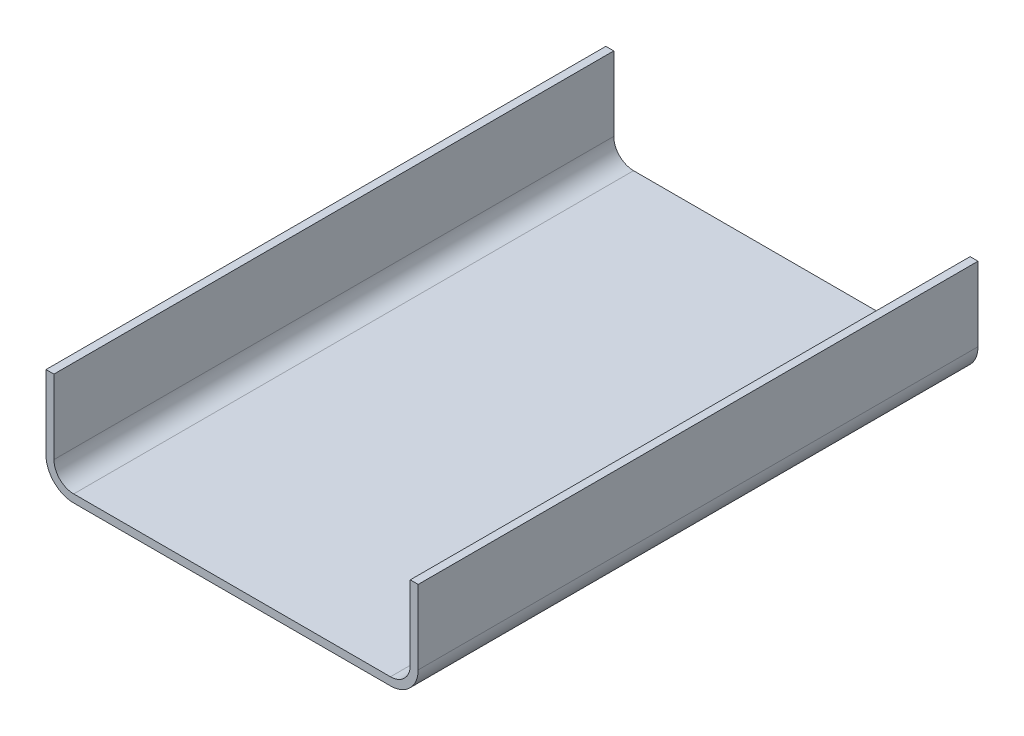
ISO-10303-21;
HEADER;
FILE_DESCRIPTION(('STEP AP214'),'2;1');
FILE_NAME('part.step','',(''),(''),'','','');
FILE_SCHEMA(('AUTOMOTIVE_DESIGN { 1 0 10303 214 1 1 1 1 }'));
ENDSEC;
DATA;
#1=APPLICATION_CONTEXT('core data for automotive mechanical design processes');
#2=APPLICATION_PROTOCOL_DEFINITION('international standard','automotive_design',2000,#1);
#3=PRODUCT_CONTEXT('',#1,'mechanical');
#4=PRODUCT('Part','Part','',(#3));
#5=PRODUCT_RELATED_PRODUCT_CATEGORY('part','',(#4));
#6=PRODUCT_DEFINITION_FORMATION('','',#4);
#7=PRODUCT_DEFINITION_CONTEXT('part definition',#1,'design');
#8=PRODUCT_DEFINITION('design','',#6,#7);
#9=PRODUCT_DEFINITION_SHAPE('','',#8);
#10=(LENGTH_UNIT() NAMED_UNIT(*) SI_UNIT(.MILLI.,.METRE.));
#11=(NAMED_UNIT(*) PLANE_ANGLE_UNIT() SI_UNIT($,.RADIAN.));
#12=(NAMED_UNIT(*) SI_UNIT($,.STERADIAN.) SOLID_ANGLE_UNIT());
#13=UNCERTAINTY_MEASURE_WITH_UNIT(LENGTH_MEASURE(1.E-05),#10,'distance_accuracy_value','');
#14=(GEOMETRIC_REPRESENTATION_CONTEXT(3) GLOBAL_UNCERTAINTY_ASSIGNED_CONTEXT((#13)) GLOBAL_UNIT_ASSIGNED_CONTEXT((#10,
#11,#12)) REPRESENTATION_CONTEXT('',''));
#15=CARTESIAN_POINT('',(0.,0.,0.));
#16=DIRECTION('',(0.,0.,1.));
#17=DIRECTION('',(1.,0.,0.));
#18=AXIS2_PLACEMENT_3D('',#15,#16,#17);
#19=CARTESIAN_POINT('',(0.,-77.851,0.));
#20=DIRECTION('',(0.,1.,0.));
#21=DIRECTION('',(0.,0.,1.));
#22=AXIS2_PLACEMENT_3D('',#19,#20,#21);
#23=PLANE('',#22);
#24=DIRECTION('',(0.,0.,-1.));
#25=VECTOR('',#24,1.);
#26=CARTESIAN_POINT('',(119.38,-77.851,156.718));
#27=LINE('',#26,#25);
#28=CARTESIAN_POINT('',(119.38,-77.851,666.242));
#29=VERTEX_POINT('',#28);
#30=CARTESIAN_POINT('',(119.38,-77.851,307.086));
#31=VERTEX_POINT('',#30);
#32=EDGE_CURVE('E11',#29,#31,#27,.T.);
#33=ORIENTED_EDGE('',*,*,#32,.T.);
#34=DIRECTION('',(1.,0.,0.));
#35=VECTOR('',#34,1.);
#36=CARTESIAN_POINT('',(114.3,-77.851,307.086));
#37=LINE('',#36,#35);
#38=CARTESIAN_POINT('',(114.3,-77.851,307.086));
#39=VERTEX_POINT('',#38);
#40=EDGE_CURVE('E197',#39,#31,#37,.T.);
#41=ORIENTED_EDGE('',*,*,#40,.F.);
#42=DIRECTION('',(0.,0.,-1.));
#43=VECTOR('',#42,1.);
#44=CARTESIAN_POINT('',(114.3,-77.851,156.718));
#45=LINE('',#44,#43);
#46=CARTESIAN_POINT('',(114.3,-77.851,666.242));
#47=VERTEX_POINT('',#46);
#48=EDGE_CURVE('E214',#47,#39,#45,.T.);
#49=ORIENTED_EDGE('',*,*,#48,.F.);
#50=DIRECTION('',(-1.,0.,0.));
#51=VECTOR('',#50,1.);
#52=CARTESIAN_POINT('',(-101.6,-77.851,666.242));
#53=LINE('',#52,#51);
#54=EDGE_CURVE('E50',#29,#47,#53,.T.);
#55=ORIENTED_EDGE('',*,*,#54,.F.);
#56=EDGE_LOOP('',(#33,#41,#49,#55));
#57=FACE_BOUND('',#56,.T.);
#58=ADVANCED_FACE('F36',(#57),#23,.T.);
#59=DIRECTION('',(1.,0.,0.));
#60=VECTOR('',#59,1.);
#61=CARTESIAN_POINT('',(-119.38,-77.851,307.086));
#62=LINE('',#61,#60);
#63=CARTESIAN_POINT('',(-119.38,-77.851,307.086));
#64=VERTEX_POINT('',#63);
#65=CARTESIAN_POINT('',(-114.3,-77.851,307.086));
#66=VERTEX_POINT('',#65);
#67=EDGE_CURVE('E209',#64,#66,#62,.T.);
#68=ORIENTED_EDGE('',*,*,#67,.F.);
#69=DIRECTION('',(0.,0.,1.));
#70=VECTOR('',#69,1.);
#71=CARTESIAN_POINT('',(-119.38,-77.851,156.718));
#72=LINE('',#71,#70);
#73=CARTESIAN_POINT('',(-119.38,-77.851,666.242));
#74=VERTEX_POINT('',#73);
#75=EDGE_CURVE('E43',#64,#74,#72,.T.);
#76=ORIENTED_EDGE('',*,*,#75,.T.);
#77=CARTESIAN_POINT('',(-114.3,-77.851,666.242));
#78=VERTEX_POINT('',#77);
#79=EDGE_CURVE('E211',#78,#74,#53,.T.);
#80=ORIENTED_EDGE('',*,*,#79,.F.);
#81=DIRECTION('',(0.,0.,1.));
#82=VECTOR('',#81,1.);
#83=CARTESIAN_POINT('',(-114.3,-77.851,156.718));
#84=LINE('',#83,#82);
#85=EDGE_CURVE('E140',#66,#78,#84,.T.);
#86=ORIENTED_EDGE('',*,*,#85,.F.);
#87=EDGE_LOOP('',(#68,#76,#80,#86));
#88=FACE_BOUND('',#87,.T.);
#89=ADVANCED_FACE('F235',(#88),#23,.T.);
#90=CARTESIAN_POINT('',(101.6,-125.349,497.332));
#91=DIRECTION('',(0.,0.,-1.));
#92=DIRECTION('',(-1.,0.,0.));
#93=AXIS2_PLACEMENT_3D('',#90,#91,#92);
#94=CYLINDRICAL_SURFACE('',#93,17.78);
#95=CARTESIAN_POINT('',(101.6,-125.349,307.086));
#96=DIRECTION('',(0.,0.,1.));
#97=DIRECTION('',(1.,0.,0.));
#98=AXIS2_PLACEMENT_3D('',#95,#96,#97);
#99=CIRCLE('',#98,17.78);
#100=CARTESIAN_POINT('',(101.6,-143.129,307.086));
#101=VERTEX_POINT('',#100);
#102=CARTESIAN_POINT('',(119.38,-125.349,307.086));
#103=VERTEX_POINT('',#102);
#104=EDGE_CURVE('E167',#101,#103,#99,.T.);
#105=ORIENTED_EDGE('',*,*,#104,.T.);
#106=DIRECTION('',(0.,0.,-1.));
#107=VECTOR('',#106,1.);
#108=CARTESIAN_POINT('',(119.38,-125.349,497.332));
#109=LINE('',#108,#107);
#110=CARTESIAN_POINT('',(119.38,-125.349,666.242));
#111=VERTEX_POINT('',#110);
#112=EDGE_CURVE('E133',#111,#103,#109,.T.);
#113=ORIENTED_EDGE('',*,*,#112,.F.);
#114=CARTESIAN_POINT('',(101.6,-125.349,666.242));
#115=DIRECTION('',(0.,0.,1.));
#116=DIRECTION('',(1.,0.,0.));
#117=AXIS2_PLACEMENT_3D('',#114,#115,#116);
#118=CIRCLE('',#117,17.78);
#119=CARTESIAN_POINT('',(101.6,-143.129,666.242));
#120=VERTEX_POINT('',#119);
#121=EDGE_CURVE('E157',#120,#111,#118,.T.);
#122=ORIENTED_EDGE('',*,*,#121,.F.);
#123=DIRECTION('',(0.,0.,-1.));
#124=VECTOR('',#123,1.);
#125=CARTESIAN_POINT('',(101.6,-143.129,497.332));
#126=LINE('',#125,#124);
#127=EDGE_CURVE('E189',#120,#101,#126,.T.);
#128=ORIENTED_EDGE('',*,*,#127,.T.);
#129=EDGE_LOOP('',(#105,#113,#122,#128));
#130=FACE_BOUND('',#129,.T.);
#131=ADVANCED_FACE('F249',(#130),#94,.T.);
#132=CARTESIAN_POINT('',(0.,-143.129,497.332));
#133=DIRECTION('',(0.,1.,0.));
#134=DIRECTION('',(0.,0.,1.));
#135=AXIS2_PLACEMENT_3D('',#132,#133,#134);
#136=PLANE('',#135);
#137=DIRECTION('',(1.,0.,0.));
#138=VECTOR('',#137,1.);
#139=CARTESIAN_POINT('',(0.,-143.129,307.086));
#140=LINE('',#139,#138);
#141=CARTESIAN_POINT('',(-101.6,-143.129,307.086));
#142=VERTEX_POINT('',#141);
#143=EDGE_CURVE('E177',#142,#101,#140,.T.);
#144=ORIENTED_EDGE('',*,*,#143,.T.);
#145=ORIENTED_EDGE('',*,*,#127,.F.);
#146=DIRECTION('',(1.,0.,0.));
#147=VECTOR('',#146,1.);
#148=CARTESIAN_POINT('',(-101.6,-143.129,666.242));
#149=LINE('',#148,#147);
#150=CARTESIAN_POINT('',(-101.6,-143.129,666.242));
#151=VERTEX_POINT('',#150);
#152=EDGE_CURVE('E154',#151,#120,#149,.T.);
#153=ORIENTED_EDGE('',*,*,#152,.F.);
#154=DIRECTION('',(0.,0.,-1.));
#155=VECTOR('',#154,1.);
#156=CARTESIAN_POINT('',(-101.6,-143.129,497.332));
#157=LINE('',#156,#155);
#158=EDGE_CURVE('E200',#151,#142,#157,.T.);
#159=ORIENTED_EDGE('',*,*,#158,.T.);
#160=EDGE_LOOP('',(#144,#145,#153,#159));
#161=FACE_BOUND('',#160,.T.);
#162=ADVANCED_FACE('F246',(#161),#136,.F.);
#163=CARTESIAN_POINT('',(-101.6,-125.349,497.332));
#164=DIRECTION('',(0.,0.,-1.));
#165=DIRECTION('',(-1.,0.,0.));
#166=AXIS2_PLACEMENT_3D('',#163,#164,#165);
#167=CYLINDRICAL_SURFACE('',#166,17.78);
#168=CARTESIAN_POINT('',(-101.6,-125.349,307.086));
#169=DIRECTION('',(0.,0.,1.));
#170=DIRECTION('',(1.,0.,0.));
#171=AXIS2_PLACEMENT_3D('',#168,#169,#170);
#172=CIRCLE('',#171,17.78);
#173=CARTESIAN_POINT('',(-119.38,-125.349,307.086));
#174=VERTEX_POINT('',#173);
#175=EDGE_CURVE('E175',#174,#142,#172,.T.);
#176=ORIENTED_EDGE('',*,*,#175,.T.);
#177=ORIENTED_EDGE('',*,*,#158,.F.);
#178=CARTESIAN_POINT('',(-101.6,-125.349,666.242));
#179=DIRECTION('',(0.,0.,1.));
#180=DIRECTION('',(1.,0.,0.));
#181=AXIS2_PLACEMENT_3D('',#178,#179,#180);
#182=CIRCLE('',#181,17.78);
#183=CARTESIAN_POINT('',(-119.38,-125.349,666.242));
#184=VERTEX_POINT('',#183);
#185=EDGE_CURVE('E151',#184,#151,#182,.T.);
#186=ORIENTED_EDGE('',*,*,#185,.F.);
#187=DIRECTION('',(0.,0.,-1.));
#188=VECTOR('',#187,1.);
#189=CARTESIAN_POINT('',(-119.38,-125.349,497.332));
#190=LINE('',#189,#188);
#191=EDGE_CURVE('E203',#184,#174,#190,.T.);
#192=ORIENTED_EDGE('',*,*,#191,.T.);
#193=EDGE_LOOP('',(#176,#177,#186,#192));
#194=FACE_BOUND('',#193,.T.);
#195=ADVANCED_FACE('F243',(#194),#167,.T.);
#196=CARTESIAN_POINT('',(-119.38,77.851,156.718));
#197=DIRECTION('',(1.,0.,0.));
#198=DIRECTION('',(0.,1.,0.));
#199=AXIS2_PLACEMENT_3D('',#196,#197,#198);
#200=PLANE('',#199);
#201=ORIENTED_EDGE('',*,*,#75,.F.);
#202=DIRECTION('',(0.,-1.,0.));
#203=VECTOR('',#202,1.);
#204=CARTESIAN_POINT('',(-119.38,0.,307.086));
#205=LINE('',#204,#203);
#206=EDGE_CURVE('E173',#64,#174,#205,.T.);
#207=ORIENTED_EDGE('',*,*,#206,.T.);
#208=ORIENTED_EDGE('',*,*,#191,.F.);
#209=DIRECTION('',(0.,-1.,0.));
#210=VECTOR('',#209,1.);
#211=CARTESIAN_POINT('',(-119.38,39.751,666.242));
#212=LINE('',#211,#210);
#213=EDGE_CURVE('E141',#74,#184,#212,.T.);
#214=ORIENTED_EDGE('',*,*,#213,.F.);
#215=EDGE_LOOP('',(#201,#207,#208,#214));
#216=FACE_BOUND('',#215,.T.);
#217=ADVANCED_FACE('F241',(#216),#200,.F.);
#218=CARTESIAN_POINT('',(-114.3,77.851,156.718));
#219=DIRECTION('',(1.,0.,0.));
#220=DIRECTION('',(0.,0.,-1.));
#221=AXIS2_PLACEMENT_3D('',#218,#219,#220);
#222=PLANE('',#221);
#223=DIRECTION('',(0.,1.,0.));
#224=VECTOR('',#223,1.);
#225=CARTESIAN_POINT('',(-114.3,0.,307.086));
#226=LINE('',#225,#224);
#227=CARTESIAN_POINT('',(-114.3,-125.349,307.086));
#228=VERTEX_POINT('',#227);
#229=EDGE_CURVE('E188',#228,#66,#226,.T.);
#230=ORIENTED_EDGE('',*,*,#229,.T.);
#231=ORIENTED_EDGE('',*,*,#85,.T.);
#232=DIRECTION('',(0.,1.,0.));
#233=VECTOR('',#232,1.);
#234=CARTESIAN_POINT('',(-114.3,-125.349,666.242));
#235=LINE('',#234,#233);
#236=CARTESIAN_POINT('',(-114.3,-125.349,666.242));
#237=VERTEX_POINT('',#236);
#238=EDGE_CURVE('E137',#237,#78,#235,.T.);
#239=ORIENTED_EDGE('',*,*,#238,.F.);
#240=DIRECTION('',(0.,0.,-1.));
#241=VECTOR('',#240,1.);
#242=CARTESIAN_POINT('',(-114.3,-125.349,497.332));
#243=LINE('',#242,#241);
#244=EDGE_CURVE('E122',#237,#228,#243,.T.);
#245=ORIENTED_EDGE('',*,*,#244,.T.);
#246=EDGE_LOOP('',(#230,#231,#239,#245));
#247=FACE_BOUND('',#246,.T.);
#248=ADVANCED_FACE('F138',(#247),#222,.T.);
#249=CARTESIAN_POINT('',(-101.6,-125.349,497.332));
#250=DIRECTION('',(0.,0.,-1.));
#251=DIRECTION('',(-1.,0.,0.));
#252=AXIS2_PLACEMENT_3D('',#249,#250,#251);
#253=CYLINDRICAL_SURFACE('',#252,12.7);
#254=CARTESIAN_POINT('',(-101.6,-125.349,307.086));
#255=DIRECTION('',(0.,0.,1.));
#256=DIRECTION('',(1.,0.,0.));
#257=AXIS2_PLACEMENT_3D('',#254,#255,#256);
#258=CIRCLE('',#257,12.7);
#259=CARTESIAN_POINT('',(-101.6,-138.049,307.086));
#260=VERTEX_POINT('',#259);
#261=EDGE_CURVE('E128',#228,#260,#258,.T.);
#262=ORIENTED_EDGE('',*,*,#261,.F.);
#263=ORIENTED_EDGE('',*,*,#244,.F.);
#264=CARTESIAN_POINT('',(-101.6,-125.349,666.242));
#265=DIRECTION('',(0.,0.,-1.));
#266=DIRECTION('',(1.,0.,0.));
#267=AXIS2_PLACEMENT_3D('',#264,#265,#266);
#268=CIRCLE('',#267,12.7);
#269=CARTESIAN_POINT('',(-101.6,-138.049,666.242));
#270=VERTEX_POINT('',#269);
#271=EDGE_CURVE('E126',#270,#237,#268,.T.);
#272=ORIENTED_EDGE('',*,*,#271,.F.);
#273=DIRECTION('',(0.,0.,-1.));
#274=VECTOR('',#273,1.);
#275=CARTESIAN_POINT('',(-101.6,-138.049,497.332));
#276=LINE('',#275,#274);
#277=EDGE_CURVE('E132',#270,#260,#276,.T.);
#278=ORIENTED_EDGE('',*,*,#277,.T.);
#279=EDGE_LOOP('',(#262,#263,#272,#278));
#280=FACE_BOUND('',#279,.T.);
#281=ADVANCED_FACE('F124',(#280),#253,.F.);
#282=CARTESIAN_POINT('',(0.,-138.049,497.332));
#283=DIRECTION('',(0.,1.,0.));
#284=DIRECTION('',(0.,0.,1.));
#285=AXIS2_PLACEMENT_3D('',#282,#283,#284);
#286=PLANE('',#285);
#287=DIRECTION('',(1.,0.,0.));
#288=VECTOR('',#287,1.);
#289=CARTESIAN_POINT('',(0.,-138.049,307.086));
#290=LINE('',#289,#288);
#291=CARTESIAN_POINT('',(101.6,-138.049,307.086));
#292=VERTEX_POINT('',#291);
#293=EDGE_CURVE('E184',#260,#292,#290,.T.);
#294=ORIENTED_EDGE('',*,*,#293,.F.);
#295=ORIENTED_EDGE('',*,*,#277,.F.);
#296=DIRECTION('',(-1.,0.,0.));
#297=VECTOR('',#296,1.);
#298=CARTESIAN_POINT('',(-101.6,-138.049,666.242));
#299=LINE('',#298,#297);
#300=CARTESIAN_POINT('',(101.6,-138.049,666.242));
#301=VERTEX_POINT('',#300);
#302=EDGE_CURVE('E147',#301,#270,#299,.T.);
#303=ORIENTED_EDGE('',*,*,#302,.F.);
#304=DIRECTION('',(0.,0.,-1.));
#305=VECTOR('',#304,1.);
#306=CARTESIAN_POINT('',(101.6,-138.049,497.332));
#307=LINE('',#306,#305);
#308=EDGE_CURVE('E192',#301,#292,#307,.T.);
#309=ORIENTED_EDGE('',*,*,#308,.T.);
#310=EDGE_LOOP('',(#294,#295,#303,#309));
#311=FACE_BOUND('',#310,.T.);
#312=ADVANCED_FACE('F230',(#311),#286,.T.);
#313=CARTESIAN_POINT('',(101.6,-125.349,497.332));
#314=DIRECTION('',(0.,0.,-1.));
#315=DIRECTION('',(-1.,0.,0.));
#316=AXIS2_PLACEMENT_3D('',#313,#314,#315);
#317=CYLINDRICAL_SURFACE('',#316,12.7);
#318=CARTESIAN_POINT('',(101.6,-125.349,307.086));
#319=DIRECTION('',(0.,0.,1.));
#320=DIRECTION('',(1.,0.,0.));
#321=AXIS2_PLACEMENT_3D('',#318,#319,#320);
#322=CIRCLE('',#321,12.7);
#323=CARTESIAN_POINT('',(114.3,-125.349,307.086));
#324=VERTEX_POINT('',#323);
#325=EDGE_CURVE('E181',#292,#324,#322,.T.);
#326=ORIENTED_EDGE('',*,*,#325,.F.);
#327=ORIENTED_EDGE('',*,*,#308,.F.);
#328=CARTESIAN_POINT('',(101.6,-125.349,666.242));
#329=DIRECTION('',(0.,0.,-1.));
#330=DIRECTION('',(1.,0.,0.));
#331=AXIS2_PLACEMENT_3D('',#328,#329,#330);
#332=CIRCLE('',#331,12.7);
#333=CARTESIAN_POINT('',(114.3,-125.349,666.242));
#334=VERTEX_POINT('',#333);
#335=EDGE_CURVE('E164',#334,#301,#332,.T.);
#336=ORIENTED_EDGE('',*,*,#335,.F.);
#337=DIRECTION('',(0.,0.,-1.));
#338=VECTOR('',#337,1.);
#339=CARTESIAN_POINT('',(114.3,-125.349,497.332));
#340=LINE('',#339,#338);
#341=EDGE_CURVE('E194',#334,#324,#340,.T.);
#342=ORIENTED_EDGE('',*,*,#341,.T.);
#343=EDGE_LOOP('',(#326,#327,#336,#342));
#344=FACE_BOUND('',#343,.T.);
#345=ADVANCED_FACE('F227',(#344),#317,.F.);
#346=CARTESIAN_POINT('',(114.3,-77.851,156.718));
#347=DIRECTION('',(-1.,0.,0.));
#348=DIRECTION('',(0.,-1.,0.));
#349=AXIS2_PLACEMENT_3D('',#346,#347,#348);
#350=PLANE('',#349);
#351=DIRECTION('',(0.,-1.,0.));
#352=VECTOR('',#351,1.);
#353=CARTESIAN_POINT('',(114.3,39.751,666.242));
#354=LINE('',#353,#352);
#355=EDGE_CURVE('E162',#47,#334,#354,.T.);
#356=ORIENTED_EDGE('',*,*,#355,.F.);
#357=ORIENTED_EDGE('',*,*,#48,.T.);
#358=DIRECTION('',(0.,-1.,0.));
#359=VECTOR('',#358,1.);
#360=CARTESIAN_POINT('',(114.3,0.,307.086));
#361=LINE('',#360,#359);
#362=EDGE_CURVE('E179',#39,#324,#361,.T.);
#363=ORIENTED_EDGE('',*,*,#362,.T.);
#364=ORIENTED_EDGE('',*,*,#341,.F.);
#365=EDGE_LOOP('',(#356,#357,#363,#364));
#366=FACE_BOUND('',#365,.T.);
#367=ADVANCED_FACE('F220',(#366),#350,.T.);
#368=CARTESIAN_POINT('',(119.38,-77.851,156.718));
#369=DIRECTION('',(-1.,0.,0.));
#370=DIRECTION('',(0.,0.,1.));
#371=AXIS2_PLACEMENT_3D('',#368,#369,#370);
#372=PLANE('',#371);
#373=ORIENTED_EDGE('',*,*,#32,.F.);
#374=DIRECTION('',(0.,1.,0.));
#375=VECTOR('',#374,1.);
#376=CARTESIAN_POINT('',(119.38,-125.349,666.242));
#377=LINE('',#376,#375);
#378=EDGE_CURVE('E160',#111,#29,#377,.T.);
#379=ORIENTED_EDGE('',*,*,#378,.F.);
#380=ORIENTED_EDGE('',*,*,#112,.T.);
#381=DIRECTION('',(0.,1.,0.));
#382=VECTOR('',#381,1.);
#383=CARTESIAN_POINT('',(119.38,0.,307.086));
#384=LINE('',#383,#382);
#385=EDGE_CURVE('E170',#103,#31,#384,.T.);
#386=ORIENTED_EDGE('',*,*,#385,.T.);
#387=EDGE_LOOP('',(#373,#379,#380,#386));
#388=FACE_BOUND('',#387,.T.);
#389=ADVANCED_FACE('F253',(#388),#372,.F.);
#390=CARTESIAN_POINT('',(-101.6,-125.349,666.242));
#391=DIRECTION('',(0.,0.,1.));
#392=DIRECTION('',(1.,0.,0.));
#393=AXIS2_PLACEMENT_3D('',#390,#391,#392);
#394=PLANE('',#393);
#395=ORIENTED_EDGE('',*,*,#378,.T.);
#396=ORIENTED_EDGE('',*,*,#54,.T.);
#397=ORIENTED_EDGE('',*,*,#355,.T.);
#398=ORIENTED_EDGE('',*,*,#335,.T.);
#399=ORIENTED_EDGE('',*,*,#302,.T.);
#400=ORIENTED_EDGE('',*,*,#271,.T.);
#401=ORIENTED_EDGE('',*,*,#238,.T.);
#402=ORIENTED_EDGE('',*,*,#79,.T.);
#403=ORIENTED_EDGE('',*,*,#213,.T.);
#404=ORIENTED_EDGE('',*,*,#185,.T.);
#405=ORIENTED_EDGE('',*,*,#152,.T.);
#406=ORIENTED_EDGE('',*,*,#121,.T.);
#407=EDGE_LOOP('',(#395,#396,#397,#398,#399,#400,#401,#402,#403,#404,#405,#406));
#408=FACE_BOUND('',#407,.T.);
#409=ADVANCED_FACE('F144',(#408),#394,.T.);
#410=CARTESIAN_POINT('',(0.,0.,307.086));
#411=DIRECTION('',(0.,0.,1.));
#412=DIRECTION('',(1.,0.,0.));
#413=AXIS2_PLACEMENT_3D('',#410,#411,#412);
#414=PLANE('',#413);
#415=ORIENTED_EDGE('',*,*,#362,.F.);
#416=ORIENTED_EDGE('',*,*,#40,.T.);
#417=ORIENTED_EDGE('',*,*,#385,.F.);
#418=ORIENTED_EDGE('',*,*,#104,.F.);
#419=ORIENTED_EDGE('',*,*,#143,.F.);
#420=ORIENTED_EDGE('',*,*,#175,.F.);
#421=ORIENTED_EDGE('',*,*,#206,.F.);
#422=ORIENTED_EDGE('',*,*,#67,.T.);
#423=ORIENTED_EDGE('',*,*,#229,.F.);
#424=ORIENTED_EDGE('',*,*,#261,.T.);
#425=ORIENTED_EDGE('',*,*,#293,.T.);
#426=ORIENTED_EDGE('',*,*,#325,.T.);
#427=EDGE_LOOP('',(#415,#416,#417,#418,#419,#420,#421,#422,#423,#424,#425,#426));
#428=FACE_BOUND('',#427,.T.);
#429=ADVANCED_FACE('F223',(#428),#414,.F.);
#430=CLOSED_SHELL('',(#58,#89,#131,#162,#195,#217,#248,#281,#312,#345,#367,#389,#409,#429));
#431=MANIFOLD_SOLID_BREP('B2',#430);
#432=ADVANCED_BREP_SHAPE_REPRESENTATION('',(#18,#431),#14);
#433=SHAPE_DEFINITION_REPRESENTATION(#9,#432);
ENDSEC;
END-ISO-10303-21;
